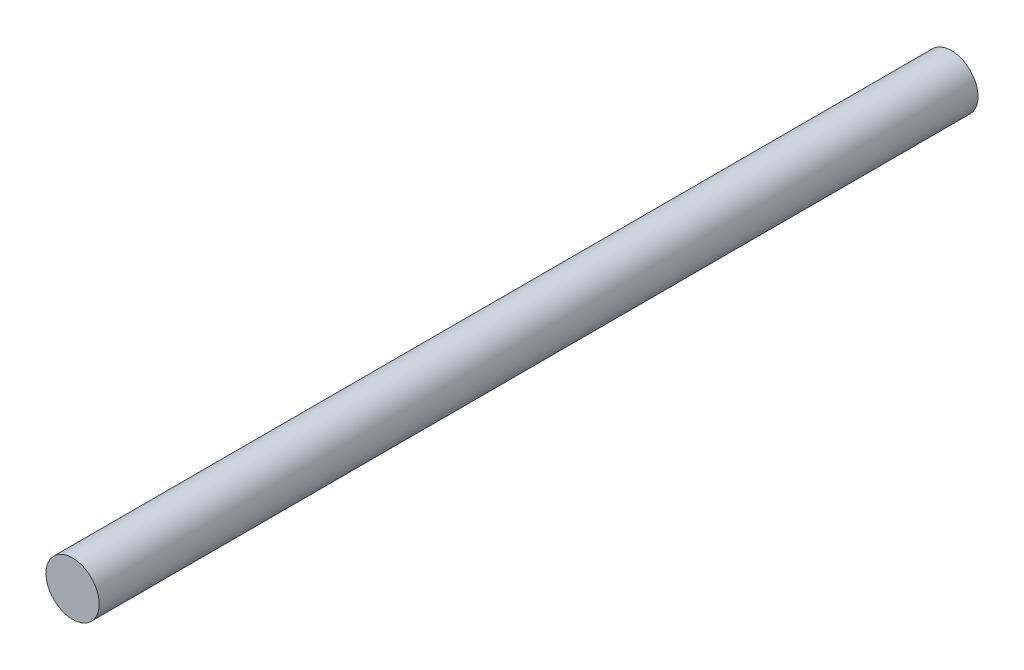
ISO-10303-21;
HEADER;
FILE_DESCRIPTION(('STEP AP214'),'2;1');
FILE_NAME('part.step','',(''),(''),'','','');
FILE_SCHEMA(('AUTOMOTIVE_DESIGN { 1 0 10303 214 1 1 1 1 }'));
ENDSEC;
DATA;
#1=APPLICATION_CONTEXT('core data for automotive mechanical design processes');
#2=APPLICATION_PROTOCOL_DEFINITION('international standard','automotive_design',2000,#1);
#3=PRODUCT_CONTEXT('',#1,'mechanical');
#4=PRODUCT('Part','Part','',(#3));
#5=PRODUCT_RELATED_PRODUCT_CATEGORY('part','',(#4));
#6=PRODUCT_DEFINITION_FORMATION('','',#4);
#7=PRODUCT_DEFINITION_CONTEXT('part definition',#1,'design');
#8=PRODUCT_DEFINITION('design','',#6,#7);
#9=PRODUCT_DEFINITION_SHAPE('','',#8);
#10=(LENGTH_UNIT() NAMED_UNIT(*) SI_UNIT(.MILLI.,.METRE.));
#11=(NAMED_UNIT(*) PLANE_ANGLE_UNIT() SI_UNIT($,.RADIAN.));
#12=(NAMED_UNIT(*) SI_UNIT($,.STERADIAN.) SOLID_ANGLE_UNIT());
#13=UNCERTAINTY_MEASURE_WITH_UNIT(LENGTH_MEASURE(1.E-05),#10,'distance_accuracy_value','');
#14=(GEOMETRIC_REPRESENTATION_CONTEXT(3) GLOBAL_UNCERTAINTY_ASSIGNED_CONTEXT((#13)) GLOBAL_UNIT_ASSIGNED_CONTEXT((#10,
#11,#12)) REPRESENTATION_CONTEXT('',''));
#15=CARTESIAN_POINT('',(0.,0.,0.));
#16=DIRECTION('',(0.,0.,1.));
#17=DIRECTION('',(1.,0.,0.));
#18=AXIS2_PLACEMENT_3D('',#15,#16,#17);
#19=CARTESIAN_POINT('',(0.,0.,457.2));
#20=DIRECTION('',(0.,0.,-1.));
#21=DIRECTION('',(-1.,0.,0.));
#22=AXIS2_PLACEMENT_3D('',#19,#20,#21);
#23=CYLINDRICAL_SURFACE('',#22,13.8471072245749);
#24=CARTESIAN_POINT('',(0.,0.,457.2));
#25=DIRECTION('',(0.,0.,1.));
#26=DIRECTION('',(1.,0.,0.));
#27=AXIS2_PLACEMENT_3D('',#24,#25,#26);
#28=CIRCLE('',#27,13.8471072245749);
#29=CARTESIAN_POINT('',(13.8471072245749,0.,457.2));
#30=VERTEX_POINT('',#29);
#31=EDGE_CURVE('E10',#30,#30,#28,.T.);
#32=ORIENTED_EDGE('',*,*,#31,.F.);
#33=EDGE_LOOP('',(#32));
#34=FACE_BOUND('',#33,.T.);
#35=CARTESIAN_POINT('',(0.,0.,0.));
#36=DIRECTION('',(0.,0.,1.));
#37=DIRECTION('',(1.,0.,0.));
#38=AXIS2_PLACEMENT_3D('',#35,#36,#37);
#39=CIRCLE('',#38,13.8471072245749);
#40=CARTESIAN_POINT('',(13.8471072245749,0.,0.));
#41=VERTEX_POINT('',#40);
#42=EDGE_CURVE('E34',#41,#41,#39,.T.);
#43=ORIENTED_EDGE('',*,*,#42,.T.);
#44=EDGE_LOOP('',(#43));
#45=FACE_BOUND('',#44,.T.);
#46=ADVANCED_FACE('F31',(#34,#45),#23,.T.);
#47=CARTESIAN_POINT('',(0.,0.,457.2));
#48=DIRECTION('',(0.,0.,1.));
#49=DIRECTION('',(1.,0.,0.));
#50=AXIS2_PLACEMENT_3D('',#47,#48,#49);
#51=PLANE('',#50);
#52=ORIENTED_EDGE('',*,*,#31,.T.);
#53=EDGE_LOOP('',(#52));
#54=FACE_BOUND('',#53,.T.);
#55=ADVANCED_FACE('F46',(#54),#51,.T.);
#56=CARTESIAN_POINT('',(0.,0.,0.));
#57=DIRECTION('',(0.,0.,1.));
#58=DIRECTION('',(1.,0.,0.));
#59=AXIS2_PLACEMENT_3D('',#56,#57,#58);
#60=PLANE('',#59);
#61=ORIENTED_EDGE('',*,*,#42,.F.);
#62=EDGE_LOOP('',(#61));
#63=FACE_BOUND('',#62,.T.);
#64=ADVANCED_FACE('F44',(#63),#60,.F.);
#65=CLOSED_SHELL('',(#46,#55,#64));
#66=MANIFOLD_SOLID_BREP('B2',#65);
#67=ADVANCED_BREP_SHAPE_REPRESENTATION('',(#18,#66),#14);
#68=SHAPE_DEFINITION_REPRESENTATION(#9,#67);
ENDSEC;
END-ISO-10303-21;
